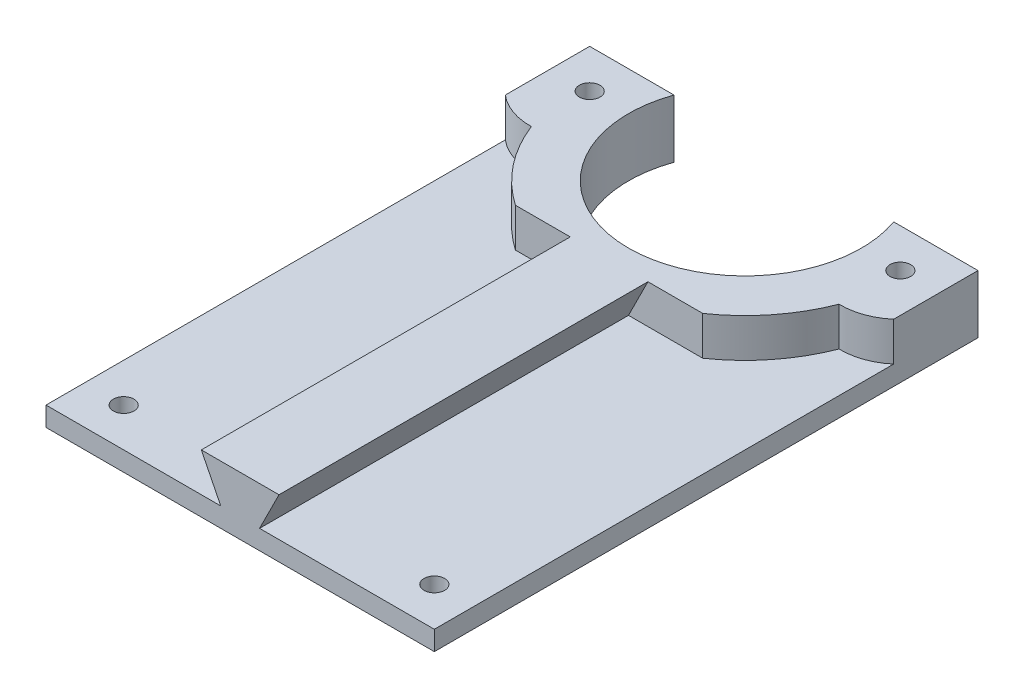
ISO-10303-21;
HEADER;
FILE_DESCRIPTION(('STEP AP214'),'2;1');
FILE_NAME('part.step','',(''),(''),'','','');
FILE_SCHEMA(('AUTOMOTIVE_DESIGN { 1 0 10303 214 1 1 1 1 }'));
ENDSEC;
DATA;
#1=APPLICATION_CONTEXT('core data for automotive mechanical design processes');
#2=APPLICATION_PROTOCOL_DEFINITION('international standard','automotive_design',2000,#1);
#3=PRODUCT_CONTEXT('',#1,'mechanical');
#4=PRODUCT('Part','Part','',(#3));
#5=PRODUCT_RELATED_PRODUCT_CATEGORY('part','',(#4));
#6=PRODUCT_DEFINITION_FORMATION('','',#4);
#7=PRODUCT_DEFINITION_CONTEXT('part definition',#1,'design');
#8=PRODUCT_DEFINITION('design','',#6,#7);
#9=PRODUCT_DEFINITION_SHAPE('','',#8);
#10=(LENGTH_UNIT() NAMED_UNIT(*) SI_UNIT(.MILLI.,.METRE.));
#11=(NAMED_UNIT(*) PLANE_ANGLE_UNIT() SI_UNIT($,.RADIAN.));
#12=(NAMED_UNIT(*) SI_UNIT($,.STERADIAN.) SOLID_ANGLE_UNIT());
#13=UNCERTAINTY_MEASURE_WITH_UNIT(LENGTH_MEASURE(1.E-05),#10,'distance_accuracy_value','');
#14=(GEOMETRIC_REPRESENTATION_CONTEXT(3) GLOBAL_UNCERTAINTY_ASSIGNED_CONTEXT((#13)) GLOBAL_UNIT_ASSIGNED_CONTEXT((#10,
#11,#12)) REPRESENTATION_CONTEXT('',''));
#15=CARTESIAN_POINT('',(0.,0.,0.));
#16=DIRECTION('',(0.,0.,1.));
#17=DIRECTION('',(1.,0.,0.));
#18=AXIS2_PLACEMENT_3D('',#15,#16,#17);
#19=CARTESIAN_POINT('',(0.,19.05,-76.2));
#20=DIRECTION('',(0.,-1.,0.));
#21=DIRECTION('',(0.,0.,-1.));
#22=AXIS2_PLACEMENT_3D('',#19,#20,#21);
#23=CYLINDRICAL_SURFACE('',#22,53.975);
#24=DIRECTION('',(0.,-1.,0.));
#25=VECTOR('',#24,1.);
#26=CARTESIAN_POINT('',(-30.6185911661526,19.05,-31.75));
#27=LINE('',#26,#25);
#28=CARTESIAN_POINT('',(-30.6185911661526,19.05,-31.75));
#29=VERTEX_POINT('',#28);
#30=CARTESIAN_POINT('',(-30.6185911661526,6.35,-31.75));
#31=VERTEX_POINT('',#30);
#32=EDGE_CURVE('E170',#29,#31,#27,.T.);
#33=ORIENTED_EDGE('',*,*,#32,.F.);
#34=CARTESIAN_POINT('',(0.,19.05,-76.2));
#35=DIRECTION('',(0.,1.,0.));
#36=DIRECTION('',(0.,0.,1.));
#37=AXIS2_PLACEMENT_3D('',#34,#35,#36);
#38=CIRCLE('',#37,53.975);
#39=CARTESIAN_POINT('',(-50.3077432342766,19.05,-56.6441416533537));
#40=VERTEX_POINT('',#39);
#41=EDGE_CURVE('E206',#40,#29,#38,.T.);
#42=ORIENTED_EDGE('',*,*,#41,.F.);
#43=DIRECTION('',(0.,-1.,0.));
#44=VECTOR('',#43,1.);
#45=CARTESIAN_POINT('',(-50.3077432342766,19.05,-56.6441416533537));
#46=LINE('',#45,#44);
#47=CARTESIAN_POINT('',(-50.3077432342766,6.35,-56.6441416533537));
#48=VERTEX_POINT('',#47);
#49=EDGE_CURVE('E244',#40,#48,#46,.T.);
#50=ORIENTED_EDGE('',*,*,#49,.T.);
#51=CARTESIAN_POINT('',(0.,6.35,-76.2));
#52=DIRECTION('',(0.,1.,0.));
#53=DIRECTION('',(0.,0.,1.));
#54=AXIS2_PLACEMENT_3D('',#51,#52,#53);
#55=CIRCLE('',#54,53.975);
#56=EDGE_CURVE('E232',#48,#31,#55,.T.);
#57=ORIENTED_EDGE('',*,*,#56,.T.);
#58=EDGE_LOOP('',(#33,#42,#50,#57));
#59=FACE_BOUND('',#58,.T.);
#60=ADVANCED_FACE('F38',(#59),#23,.T.);
#61=DIRECTION('',(0.,-1.,0.));
#62=VECTOR('',#61,1.);
#63=CARTESIAN_POINT('',(30.6185911661526,19.05,-31.75));
#64=LINE('',#63,#62);
#65=CARTESIAN_POINT('',(30.6185911661526,6.35,-31.75));
#66=VERTEX_POINT('',#65);
#67=CARTESIAN_POINT('',(30.6185911661526,19.05,-31.75));
#68=VERTEX_POINT('',#67);
#69=EDGE_CURVE('E61',#66,#68,#64,.F.);
#70=ORIENTED_EDGE('',*,*,#69,.F.);
#71=CARTESIAN_POINT('',(50.3077432342766,6.35,-56.6441416533537));
#72=VERTEX_POINT('',#71);
#73=EDGE_CURVE('E231',#66,#72,#55,.T.);
#74=ORIENTED_EDGE('',*,*,#73,.T.);
#75=DIRECTION('',(0.,-1.,0.));
#76=VECTOR('',#75,1.);
#77=CARTESIAN_POINT('',(50.3077432342766,19.05,-56.6441416533537));
#78=LINE('',#77,#76);
#79=CARTESIAN_POINT('',(50.3077432342766,19.05,-56.6441416533537));
#80=VERTEX_POINT('',#79);
#81=EDGE_CURVE('E241',#80,#72,#78,.T.);
#82=ORIENTED_EDGE('',*,*,#81,.F.);
#83=EDGE_CURVE('E205',#68,#80,#38,.T.);
#84=ORIENTED_EDGE('',*,*,#83,.F.);
#85=EDGE_LOOP('',(#70,#74,#82,#84));
#86=FACE_BOUND('',#85,.T.);
#87=ADVANCED_FACE('F312',(#86),#23,.T.);
#88=CARTESIAN_POINT('',(0.,19.05,0.));
#89=DIRECTION('',(0.,1.,0.));
#90=DIRECTION('',(0.,0.,1.));
#91=AXIS2_PLACEMENT_3D('',#88,#89,#90);
#92=PLANE('',#91);
#93=CARTESIAN_POINT('',(50.8,19.05,-76.2));
#94=DIRECTION('',(0.,1.,0.));
#95=DIRECTION('',(0.,0.,1.));
#96=AXIS2_PLACEMENT_3D('',#93,#94,#95);
#97=CIRCLE('',#96,3.3782);
#98=CARTESIAN_POINT('',(50.8,19.05,-72.8218));
#99=VERTEX_POINT('',#98);
#100=EDGE_CURVE('E198',#99,#99,#97,.F.);
#101=ORIENTED_EDGE('',*,*,#100,.T.);
#102=EDGE_LOOP('',(#101));
#103=FACE_BOUND('',#102,.T.);
#104=CARTESIAN_POINT('',(-50.8,19.05,-76.2));
#105=DIRECTION('',(0.,1.,0.));
#106=DIRECTION('',(0.,0.,1.));
#107=AXIS2_PLACEMENT_3D('',#104,#105,#106);
#108=CIRCLE('',#107,3.3782);
#109=CARTESIAN_POINT('',(-50.8,19.05,-72.8218));
#110=VERTEX_POINT('',#109);
#111=EDGE_CURVE('E225',#110,#110,#108,.F.);
#112=ORIENTED_EDGE('',*,*,#111,.T.);
#113=EDGE_LOOP('',(#112));
#114=FACE_BOUND('',#113,.T.);
#115=DIRECTION('',(-1.,0.,0.));
#116=VECTOR('',#115,1.);
#117=CARTESIAN_POINT('',(0.,19.05,-31.75));
#118=LINE('',#117,#116);
#119=CARTESIAN_POINT('',(-12.7,19.05,-31.75));
#120=VERTEX_POINT('',#119);
#121=EDGE_CURVE('E171',#120,#29,#118,.T.);
#122=ORIENTED_EDGE('',*,*,#121,.F.);
#123=DIRECTION('',(0.,0.,1.));
#124=VECTOR('',#123,1.);
#125=CARTESIAN_POINT('',(-12.7,19.05,-32.766));
#126=LINE('',#125,#124);
#127=CARTESIAN_POINT('',(-12.7,19.05,88.9));
#128=VERTEX_POINT('',#127);
#129=EDGE_CURVE('E53',#120,#128,#126,.T.);
#130=ORIENTED_EDGE('',*,*,#129,.T.);
#131=DIRECTION('',(1.,0.,0.));
#132=VECTOR('',#131,1.);
#133=CARTESIAN_POINT('',(0.,19.05,88.9));
#134=LINE('',#133,#132);
#135=CARTESIAN_POINT('',(12.7,19.05,88.9));
#136=VERTEX_POINT('',#135);
#137=EDGE_CURVE('E188',#128,#136,#134,.T.);
#138=ORIENTED_EDGE('',*,*,#137,.T.);
#139=DIRECTION('',(0.,0.,1.));
#140=VECTOR('',#139,1.);
#141=CARTESIAN_POINT('',(12.7,19.05,-32.766));
#142=LINE('',#141,#140);
#143=CARTESIAN_POINT('',(12.7,19.05,-31.75));
#144=VERTEX_POINT('',#143);
#145=EDGE_CURVE('E195',#144,#136,#142,.T.);
#146=ORIENTED_EDGE('',*,*,#145,.F.);
#147=DIRECTION('',(-1.,0.,0.));
#148=VECTOR('',#147,1.);
#149=CARTESIAN_POINT('',(0.,19.05,-31.75));
#150=LINE('',#149,#148);
#151=EDGE_CURVE('E179',#68,#144,#150,.T.);
#152=ORIENTED_EDGE('',*,*,#151,.F.);
#153=ORIENTED_EDGE('',*,*,#83,.T.);
#154=CARTESIAN_POINT('',(50.8,19.05,-76.2));
#155=DIRECTION('',(0.,1.,0.));
#156=DIRECTION('',(0.,0.,1.));
#157=AXIS2_PLACEMENT_3D('',#154,#155,#156);
#158=CIRCLE('',#157,19.5620528676695);
#159=CARTESIAN_POINT('',(63.5,19.05,-61.3210244842766));
#160=VERTEX_POINT('',#159);
#161=EDGE_CURVE('E209',#80,#160,#158,.T.);
#162=ORIENTED_EDGE('',*,*,#161,.T.);
#163=DIRECTION('',(0.,0.,-1.));
#164=VECTOR('',#163,1.);
#165=CARTESIAN_POINT('',(63.5,19.05,0.));
#166=LINE('',#165,#164);
#167=CARTESIAN_POINT('',(63.5,19.05,-88.9));
#168=VERTEX_POINT('',#167);
#169=EDGE_CURVE('E211',#160,#168,#166,.T.);
#170=ORIENTED_EDGE('',*,*,#169,.T.);
#171=DIRECTION('',(-1.,0.,0.));
#172=VECTOR('',#171,1.);
#173=CARTESIAN_POINT('',(0.,19.05,-88.9));
#174=LINE('',#173,#172);
#175=CARTESIAN_POINT('',(35.9210244842766,19.05,-88.9));
#176=VERTEX_POINT('',#175);
#177=EDGE_CURVE('E214',#168,#176,#174,.T.);
#178=ORIENTED_EDGE('',*,*,#177,.T.);
#179=CARTESIAN_POINT('',(0.,19.05,-76.2));
#180=DIRECTION('',(0.,1.,0.));
#181=DIRECTION('',(0.,0.,1.));
#182=AXIS2_PLACEMENT_3D('',#179,#180,#181);
#183=CIRCLE('',#182,38.1);
#184=CARTESIAN_POINT('',(-35.9210244842766,19.05,-88.9));
#185=VERTEX_POINT('',#184);
#186=EDGE_CURVE('E217',#176,#185,#183,.F.);
#187=ORIENTED_EDGE('',*,*,#186,.T.);
#188=DIRECTION('',(-1.,0.,0.));
#189=VECTOR('',#188,1.);
#190=CARTESIAN_POINT('',(0.,19.05,-88.9));
#191=LINE('',#190,#189);
#192=CARTESIAN_POINT('',(-63.5,19.05,-88.9));
#193=VERTEX_POINT('',#192);
#194=EDGE_CURVE('E220',#185,#193,#191,.T.);
#195=ORIENTED_EDGE('',*,*,#194,.T.);
#196=DIRECTION('',(0.,0.,1.));
#197=VECTOR('',#196,1.);
#198=CARTESIAN_POINT('',(-63.5,19.05,0.));
#199=LINE('',#198,#197);
#200=CARTESIAN_POINT('',(-63.5,19.05,-61.3210244842766));
#201=VERTEX_POINT('',#200);
#202=EDGE_CURVE('E223',#193,#201,#199,.T.);
#203=ORIENTED_EDGE('',*,*,#202,.T.);
#204=CARTESIAN_POINT('',(-50.8,19.05,-76.2));
#205=DIRECTION('',(0.,1.,0.));
#206=DIRECTION('',(0.,0.,1.));
#207=AXIS2_PLACEMENT_3D('',#204,#205,#206);
#208=CIRCLE('',#207,19.5620528676695);
#209=EDGE_CURVE('E201',#201,#40,#208,.T.);
#210=ORIENTED_EDGE('',*,*,#209,.T.);
#211=ORIENTED_EDGE('',*,*,#41,.T.);
#212=EDGE_LOOP('',(#122,#130,#138,#146,#152,#153,#162,#170,#178,#187,#195,#203,#210,#211));
#213=FACE_BOUND('',#212,.T.);
#214=ADVANCED_FACE('F309',(#103,#114,#213),#92,.T.);
#215=CARTESIAN_POINT('',(0.,6.35,0.));
#216=DIRECTION('',(0.,1.,0.));
#217=DIRECTION('',(0.,0.,1.));
#218=AXIS2_PLACEMENT_3D('',#215,#216,#217);
#219=PLANE('',#218);
#220=CARTESIAN_POINT('',(-50.8,6.35,76.2));
#221=DIRECTION('',(0.,1.,0.));
#222=DIRECTION('',(0.,0.,1.));
#223=AXIS2_PLACEMENT_3D('',#220,#221,#222);
#224=CIRCLE('',#223,3.3782);
#225=CARTESIAN_POINT('',(-50.8,6.35,79.5782));
#226=VERTEX_POINT('',#225);
#227=EDGE_CURVE('E257',#226,#226,#224,.T.);
#228=ORIENTED_EDGE('',*,*,#227,.F.);
#229=EDGE_LOOP('',(#228));
#230=FACE_BOUND('',#229,.T.);
#231=DIRECTION('',(1.,0.,0.));
#232=VECTOR('',#231,1.);
#233=CARTESIAN_POINT('',(63.5,6.35,88.8999999999999));
#234=LINE('',#233,#232);
#235=CARTESIAN_POINT('',(-63.5,6.35,88.9));
#236=VERTEX_POINT('',#235);
#237=CARTESIAN_POINT('',(-6.34999999999997,6.35,88.9));
#238=VERTEX_POINT('',#237);
#239=EDGE_CURVE('E159',#236,#238,#234,.T.);
#240=ORIENTED_EDGE('',*,*,#239,.T.);
#241=DIRECTION('',(0.,0.,1.));
#242=VECTOR('',#241,1.);
#243=CARTESIAN_POINT('',(-6.34999999999997,6.35,-32.766));
#244=LINE('',#243,#242);
#245=CARTESIAN_POINT('',(-6.34999999999997,6.35,-31.75));
#246=VERTEX_POINT('',#245);
#247=EDGE_CURVE('E153',#246,#238,#244,.T.);
#248=ORIENTED_EDGE('',*,*,#247,.F.);
#249=DIRECTION('',(-1.,0.,0.));
#250=VECTOR('',#249,1.);
#251=CARTESIAN_POINT('',(0.,6.35,-31.75));
#252=LINE('',#251,#250);
#253=EDGE_CURVE('E156',#246,#31,#252,.T.);
#254=ORIENTED_EDGE('',*,*,#253,.T.);
#255=ORIENTED_EDGE('',*,*,#56,.F.);
#256=CARTESIAN_POINT('',(-50.8,6.35,-76.2));
#257=DIRECTION('',(0.,1.,0.));
#258=DIRECTION('',(0.,0.,1.));
#259=AXIS2_PLACEMENT_3D('',#256,#257,#258);
#260=CIRCLE('',#259,19.5620528676695);
#261=CARTESIAN_POINT('',(-63.5,6.35,-61.3210244842766));
#262=VERTEX_POINT('',#261);
#263=EDGE_CURVE('E161',#262,#48,#260,.T.);
#264=ORIENTED_EDGE('',*,*,#263,.F.);
#265=DIRECTION('',(0.,0.,1.));
#266=VECTOR('',#265,1.);
#267=CARTESIAN_POINT('',(-63.5,6.35,88.9));
#268=LINE('',#267,#266);
#269=EDGE_CURVE('E262',#262,#236,#268,.T.);
#270=ORIENTED_EDGE('',*,*,#269,.T.);
#271=EDGE_LOOP('',(#240,#248,#254,#255,#264,#270));
#272=FACE_BOUND('',#271,.T.);
#273=ADVANCED_FACE('F154',(#230,#272),#219,.T.);
#274=CARTESIAN_POINT('',(50.8,6.35,76.2));
#275=DIRECTION('',(0.,1.,0.));
#276=DIRECTION('',(0.,0.,1.));
#277=AXIS2_PLACEMENT_3D('',#274,#275,#276);
#278=CIRCLE('',#277,3.3782);
#279=CARTESIAN_POINT('',(50.8,6.35,79.5782));
#280=VERTEX_POINT('',#279);
#281=EDGE_CURVE('E253',#280,#280,#278,.T.);
#282=ORIENTED_EDGE('',*,*,#281,.F.);
#283=EDGE_LOOP('',(#282));
#284=FACE_BOUND('',#283,.T.);
#285=CARTESIAN_POINT('',(6.35000000000003,6.35,88.9));
#286=VERTEX_POINT('',#285);
#287=CARTESIAN_POINT('',(63.5,6.35,88.8999999999999));
#288=VERTEX_POINT('',#287);
#289=EDGE_CURVE('E264',#286,#288,#234,.T.);
#290=ORIENTED_EDGE('',*,*,#289,.T.);
#291=DIRECTION('',(0.,0.,-1.));
#292=VECTOR('',#291,1.);
#293=CARTESIAN_POINT('',(63.5,6.35,88.8999999999999));
#294=LINE('',#293,#292);
#295=CARTESIAN_POINT('',(63.5,6.35,-61.3210244842766));
#296=VERTEX_POINT('',#295);
#297=EDGE_CURVE('E267',#288,#296,#294,.T.);
#298=ORIENTED_EDGE('',*,*,#297,.T.);
#299=CARTESIAN_POINT('',(50.8,6.35,-76.2));
#300=DIRECTION('',(0.,1.,0.));
#301=DIRECTION('',(0.,0.,1.));
#302=AXIS2_PLACEMENT_3D('',#299,#300,#301);
#303=CIRCLE('',#302,19.5620528676695);
#304=EDGE_CURVE('E202',#72,#296,#303,.T.);
#305=ORIENTED_EDGE('',*,*,#304,.F.);
#306=ORIENTED_EDGE('',*,*,#73,.F.);
#307=DIRECTION('',(-1.,0.,0.));
#308=VECTOR('',#307,1.);
#309=CARTESIAN_POINT('',(0.,6.35,-31.75));
#310=LINE('',#309,#308);
#311=CARTESIAN_POINT('',(6.35000000000003,6.35,-31.75));
#312=VERTEX_POINT('',#311);
#313=EDGE_CURVE('E176',#66,#312,#310,.T.);
#314=ORIENTED_EDGE('',*,*,#313,.T.);
#315=DIRECTION('',(0.,0.,1.));
#316=VECTOR('',#315,1.);
#317=CARTESIAN_POINT('',(6.35000000000003,6.35,-32.766));
#318=LINE('',#317,#316);
#319=EDGE_CURVE('E192',#312,#286,#318,.T.);
#320=ORIENTED_EDGE('',*,*,#319,.T.);
#321=EDGE_LOOP('',(#290,#298,#305,#306,#314,#320));
#322=FACE_BOUND('',#321,.T.);
#323=ADVANCED_FACE('F345',(#284,#322),#219,.T.);
#324=CARTESIAN_POINT('',(63.5,6.35,-88.9));
#325=DIRECTION('',(0.,0.,1.));
#326=DIRECTION('',(1.,0.,0.));
#327=AXIS2_PLACEMENT_3D('',#324,#325,#326);
#328=PLANE('',#327);
#329=DIRECTION('',(-1.,0.,0.));
#330=VECTOR('',#329,1.);
#331=CARTESIAN_POINT('',(63.5,0.,-88.9));
#332=LINE('',#331,#330);
#333=CARTESIAN_POINT('',(63.5,0.,-88.9));
#334=VERTEX_POINT('',#333);
#335=CARTESIAN_POINT('',(35.9210244842766,0.,-88.9));
#336=VERTEX_POINT('',#335);
#337=EDGE_CURVE('E265',#334,#336,#332,.T.);
#338=ORIENTED_EDGE('',*,*,#337,.T.);
#339=DIRECTION('',(0.,1.,0.));
#340=VECTOR('',#339,1.);
#341=CARTESIAN_POINT('',(35.9210244842766,0.,-88.9));
#342=LINE('',#341,#340);
#343=EDGE_CURVE('E250',#336,#176,#342,.T.);
#344=ORIENTED_EDGE('',*,*,#343,.T.);
#345=ORIENTED_EDGE('',*,*,#177,.F.);
#346=DIRECTION('',(0.,-1.,0.));
#347=VECTOR('',#346,1.);
#348=CARTESIAN_POINT('',(63.5,6.35,-88.9));
#349=LINE('',#348,#347);
#350=EDGE_CURVE('E282',#168,#334,#349,.T.);
#351=ORIENTED_EDGE('',*,*,#350,.T.);
#352=EDGE_LOOP('',(#338,#344,#345,#351));
#353=FACE_BOUND('',#352,.T.);
#354=ADVANCED_FACE('F359',(#353),#328,.F.);
#355=CARTESIAN_POINT('',(-63.5,6.35,88.9));
#356=DIRECTION('',(1.,0.,0.));
#357=DIRECTION('',(0.,0.,-1.));
#358=AXIS2_PLACEMENT_3D('',#355,#356,#357);
#359=PLANE('',#358);
#360=DIRECTION('',(0.,0.,1.));
#361=VECTOR('',#360,1.);
#362=CARTESIAN_POINT('',(-63.5,0.,88.9));
#363=LINE('',#362,#361);
#364=CARTESIAN_POINT('',(-63.5,0.,-88.9));
#365=VERTEX_POINT('',#364);
#366=CARTESIAN_POINT('',(-63.5,0.,88.9));
#367=VERTEX_POINT('',#366);
#368=EDGE_CURVE('E270',#365,#367,#363,.T.);
#369=ORIENTED_EDGE('',*,*,#368,.T.);
#370=DIRECTION('',(0.,-1.,0.));
#371=VECTOR('',#370,1.);
#372=CARTESIAN_POINT('',(-63.5,6.35,88.9));
#373=LINE('',#372,#371);
#374=EDGE_CURVE('E46',#236,#367,#373,.T.);
#375=ORIENTED_EDGE('',*,*,#374,.F.);
#376=ORIENTED_EDGE('',*,*,#269,.F.);
#377=DIRECTION('',(0.,-1.,0.));
#378=VECTOR('',#377,1.);
#379=CARTESIAN_POINT('',(-63.5,19.05,-61.3210244842766));
#380=LINE('',#379,#378);
#381=EDGE_CURVE('E228',#201,#262,#380,.T.);
#382=ORIENTED_EDGE('',*,*,#381,.F.);
#383=ORIENTED_EDGE('',*,*,#202,.F.);
#384=DIRECTION('',(0.,-1.,0.));
#385=VECTOR('',#384,1.);
#386=CARTESIAN_POINT('',(-63.5,6.35,-88.9));
#387=LINE('',#386,#385);
#388=EDGE_CURVE('E269',#193,#365,#387,.T.);
#389=ORIENTED_EDGE('',*,*,#388,.T.);
#390=EDGE_LOOP('',(#369,#375,#376,#382,#383,#389));
#391=FACE_BOUND('',#390,.T.);
#392=ADVANCED_FACE('F40',(#391),#359,.F.);
#393=CARTESIAN_POINT('',(63.5,6.35,88.8999999999999));
#394=DIRECTION('',(0.,0.,-1.));
#395=DIRECTION('',(-1.,0.,0.));
#396=AXIS2_PLACEMENT_3D('',#393,#394,#395);
#397=PLANE('',#396);
#398=DIRECTION('',(1.,0.,0.));
#399=VECTOR('',#398,1.);
#400=CARTESIAN_POINT('',(63.5,0.,88.8999999999999));
#401=LINE('',#400,#399);
#402=CARTESIAN_POINT('',(63.5,0.,88.8999999999999));
#403=VERTEX_POINT('',#402);
#404=EDGE_CURVE('E273',#367,#403,#401,.T.);
#405=ORIENTED_EDGE('',*,*,#404,.T.);
#406=DIRECTION('',(0.,-1.,0.));
#407=VECTOR('',#406,1.);
#408=CARTESIAN_POINT('',(63.5,6.35,88.8999999999999));
#409=LINE('',#408,#407);
#410=EDGE_CURVE('E285',#288,#403,#409,.T.);
#411=ORIENTED_EDGE('',*,*,#410,.F.);
#412=ORIENTED_EDGE('',*,*,#289,.F.);
#413=DIRECTION('',(-0.447213595499958,-0.894427190999916,0.));
#414=VECTOR('',#413,1.);
#415=CARTESIAN_POINT('',(2.54000000000002,-1.27000000000001,88.9));
#416=LINE('',#415,#414);
#417=EDGE_CURVE('E185',#136,#286,#416,.T.);
#418=ORIENTED_EDGE('',*,*,#417,.F.);
#419=ORIENTED_EDGE('',*,*,#137,.F.);
#420=DIRECTION('',(-0.447213595499958,0.894427190999916,0.));
#421=VECTOR('',#420,1.);
#422=CARTESIAN_POINT('',(-2.53999999999998,-1.26999999999999,88.9));
#423=LINE('',#422,#421);
#424=EDGE_CURVE('E191',#238,#128,#423,.T.);
#425=ORIENTED_EDGE('',*,*,#424,.F.);
#426=ORIENTED_EDGE('',*,*,#239,.F.);
#427=ORIENTED_EDGE('',*,*,#374,.T.);
#428=EDGE_LOOP('',(#405,#411,#412,#418,#419,#425,#426,#427));
#429=FACE_BOUND('',#428,.T.);
#430=ADVANCED_FACE('F334',(#429),#397,.F.);
#431=CARTESIAN_POINT('',(63.5,6.35,88.8999999999999));
#432=DIRECTION('',(-1.,0.,0.));
#433=DIRECTION('',(0.,0.,1.));
#434=AXIS2_PLACEMENT_3D('',#431,#432,#433);
#435=PLANE('',#434);
#436=DIRECTION('',(0.,0.,-1.));
#437=VECTOR('',#436,1.);
#438=CARTESIAN_POINT('',(63.5,0.,88.8999999999999));
#439=LINE('',#438,#437);
#440=EDGE_CURVE('E275',#403,#334,#439,.T.);
#441=ORIENTED_EDGE('',*,*,#440,.T.);
#442=ORIENTED_EDGE('',*,*,#350,.F.);
#443=ORIENTED_EDGE('',*,*,#169,.F.);
#444=DIRECTION('',(0.,-1.,0.));
#445=VECTOR('',#444,1.);
#446=CARTESIAN_POINT('',(63.5,19.05,-61.3210244842766));
#447=LINE('',#446,#445);
#448=EDGE_CURVE('E238',#160,#296,#447,.T.);
#449=ORIENTED_EDGE('',*,*,#448,.T.);
#450=ORIENTED_EDGE('',*,*,#297,.F.);
#451=ORIENTED_EDGE('',*,*,#410,.T.);
#452=EDGE_LOOP('',(#441,#442,#443,#449,#450,#451));
#453=FACE_BOUND('',#452,.T.);
#454=ADVANCED_FACE('F357',(#453),#435,.F.);
#455=ORIENTED_EDGE('',*,*,#388,.F.);
#456=ORIENTED_EDGE('',*,*,#194,.F.);
#457=DIRECTION('',(0.,1.,0.));
#458=VECTOR('',#457,1.);
#459=CARTESIAN_POINT('',(-35.9210244842766,0.,-88.9));
#460=LINE('',#459,#458);
#461=CARTESIAN_POINT('',(-35.9210244842766,0.,-88.9));
#462=VERTEX_POINT('',#461);
#463=EDGE_CURVE('E247',#185,#462,#460,.F.);
#464=ORIENTED_EDGE('',*,*,#463,.T.);
#465=EDGE_CURVE('E277',#462,#365,#332,.T.);
#466=ORIENTED_EDGE('',*,*,#465,.T.);
#467=EDGE_LOOP('',(#455,#456,#464,#466));
#468=FACE_BOUND('',#467,.T.);
#469=ADVANCED_FACE('F362',(#468),#328,.F.);
#470=CARTESIAN_POINT('',(0.,0.,0.));
#471=DIRECTION('',(0.,1.,0.));
#472=DIRECTION('',(0.,0.,1.));
#473=AXIS2_PLACEMENT_3D('',#470,#471,#472);
#474=PLANE('',#473);
#475=CARTESIAN_POINT('',(-50.8,0.,-76.2));
#476=DIRECTION('',(0.,1.,0.));
#477=DIRECTION('',(0.,0.,1.));
#478=AXIS2_PLACEMENT_3D('',#475,#476,#477);
#479=CIRCLE('',#478,3.3782);
#480=CARTESIAN_POINT('',(-50.8,0.,-72.8218));
#481=VERTEX_POINT('',#480);
#482=EDGE_CURVE('E252',#481,#481,#479,.T.);
#483=ORIENTED_EDGE('',*,*,#482,.T.);
#484=EDGE_LOOP('',(#483));
#485=FACE_BOUND('',#484,.T.);
#486=CARTESIAN_POINT('',(50.8,0.,76.2));
#487=DIRECTION('',(0.,1.,0.));
#488=DIRECTION('',(0.,0.,1.));
#489=AXIS2_PLACEMENT_3D('',#486,#487,#488);
#490=CIRCLE('',#489,3.3782);
#491=CARTESIAN_POINT('',(50.8,0.,79.5782));
#492=VERTEX_POINT('',#491);
#493=EDGE_CURVE('E256',#492,#492,#490,.T.);
#494=ORIENTED_EDGE('',*,*,#493,.T.);
#495=EDGE_LOOP('',(#494));
#496=FACE_BOUND('',#495,.T.);
#497=CARTESIAN_POINT('',(50.8,0.,-76.2));
#498=DIRECTION('',(0.,1.,0.));
#499=DIRECTION('',(0.,0.,1.));
#500=AXIS2_PLACEMENT_3D('',#497,#498,#499);
#501=CIRCLE('',#500,3.3782);
#502=CARTESIAN_POINT('',(50.8,0.,-72.8218));
#503=VERTEX_POINT('',#502);
#504=EDGE_CURVE('E261',#503,#503,#501,.T.);
#505=ORIENTED_EDGE('',*,*,#504,.T.);
#506=EDGE_LOOP('',(#505));
#507=FACE_BOUND('',#506,.T.);
#508=CARTESIAN_POINT('',(-50.8,0.,76.2));
#509=DIRECTION('',(0.,1.,0.));
#510=DIRECTION('',(0.,0.,1.));
#511=AXIS2_PLACEMENT_3D('',#508,#509,#510);
#512=CIRCLE('',#511,3.3782);
#513=CARTESIAN_POINT('',(-50.8,0.,79.5782));
#514=VERTEX_POINT('',#513);
#515=EDGE_CURVE('E260',#514,#514,#512,.T.);
#516=ORIENTED_EDGE('',*,*,#515,.T.);
#517=EDGE_LOOP('',(#516));
#518=FACE_BOUND('',#517,.T.);
#519=ORIENTED_EDGE('',*,*,#465,.F.);
#520=CARTESIAN_POINT('',(0.,0.,-76.2));
#521=DIRECTION('',(0.,1.,0.));
#522=DIRECTION('',(0.,0.,1.));
#523=AXIS2_PLACEMENT_3D('',#520,#521,#522);
#524=CIRCLE('',#523,38.1);
#525=EDGE_CURVE('E11',#462,#336,#524,.T.);
#526=ORIENTED_EDGE('',*,*,#525,.T.);
#527=ORIENTED_EDGE('',*,*,#337,.F.);
#528=ORIENTED_EDGE('',*,*,#440,.F.);
#529=ORIENTED_EDGE('',*,*,#404,.F.);
#530=ORIENTED_EDGE('',*,*,#368,.F.);
#531=EDGE_LOOP('',(#519,#526,#527,#528,#529,#530));
#532=FACE_BOUND('',#531,.T.);
#533=ADVANCED_FACE('F298',(#485,#496,#507,#518,#532),#474,.F.);
#534=CARTESIAN_POINT('',(-50.8,6.35,76.2));
#535=DIRECTION('',(0.,1.,0.));
#536=DIRECTION('',(0.,0.,1.));
#537=AXIS2_PLACEMENT_3D('',#534,#535,#536);
#538=CYLINDRICAL_SURFACE('',#537,3.3782);
#539=ORIENTED_EDGE('',*,*,#227,.T.);
#540=EDGE_LOOP('',(#539));
#541=FACE_BOUND('',#540,.T.);
#542=ORIENTED_EDGE('',*,*,#515,.F.);
#543=EDGE_LOOP('',(#542));
#544=FACE_BOUND('',#543,.T.);
#545=ADVANCED_FACE('F369',(#541,#544),#538,.F.);
#546=CARTESIAN_POINT('',(50.8,6.35,-76.2));
#547=DIRECTION('',(0.,1.,0.));
#548=DIRECTION('',(0.,0.,1.));
#549=AXIS2_PLACEMENT_3D('',#546,#547,#548);
#550=CYLINDRICAL_SURFACE('',#549,3.3782);
#551=ORIENTED_EDGE('',*,*,#504,.F.);
#552=EDGE_LOOP('',(#551));
#553=FACE_BOUND('',#552,.T.);
#554=ORIENTED_EDGE('',*,*,#100,.F.);
#555=EDGE_LOOP('',(#554));
#556=FACE_BOUND('',#555,.T.);
#557=ADVANCED_FACE('F386',(#553,#556),#550,.F.);
#558=CARTESIAN_POINT('',(50.8,6.35,76.2));
#559=DIRECTION('',(0.,1.,0.));
#560=DIRECTION('',(0.,0.,1.));
#561=AXIS2_PLACEMENT_3D('',#558,#559,#560);
#562=CYLINDRICAL_SURFACE('',#561,3.3782);
#563=ORIENTED_EDGE('',*,*,#281,.T.);
#564=EDGE_LOOP('',(#563));
#565=FACE_BOUND('',#564,.T.);
#566=ORIENTED_EDGE('',*,*,#493,.F.);
#567=EDGE_LOOP('',(#566));
#568=FACE_BOUND('',#567,.T.);
#569=ADVANCED_FACE('F305',(#565,#568),#562,.F.);
#570=CARTESIAN_POINT('',(-50.8,6.35,-76.2));
#571=DIRECTION('',(0.,1.,0.));
#572=DIRECTION('',(0.,0.,1.));
#573=AXIS2_PLACEMENT_3D('',#570,#571,#572);
#574=CYLINDRICAL_SURFACE('',#573,3.3782);
#575=ORIENTED_EDGE('',*,*,#482,.F.);
#576=EDGE_LOOP('',(#575));
#577=FACE_BOUND('',#576,.T.);
#578=ORIENTED_EDGE('',*,*,#111,.F.);
#579=EDGE_LOOP('',(#578));
#580=FACE_BOUND('',#579,.T.);
#581=ADVANCED_FACE('F301',(#577,#580),#574,.F.);
#582=CARTESIAN_POINT('',(0.,0.,-76.2));
#583=DIRECTION('',(0.,1.,0.));
#584=DIRECTION('',(0.,0.,1.));
#585=AXIS2_PLACEMENT_3D('',#582,#583,#584);
#586=CYLINDRICAL_SURFACE('',#585,38.1);
#587=ORIENTED_EDGE('',*,*,#525,.F.);
#588=ORIENTED_EDGE('',*,*,#463,.F.);
#589=ORIENTED_EDGE('',*,*,#186,.F.);
#590=ORIENTED_EDGE('',*,*,#343,.F.);
#591=EDGE_LOOP('',(#587,#588,#589,#590));
#592=FACE_BOUND('',#591,.T.);
#593=ADVANCED_FACE('F304',(#592),#586,.F.);
#594=CARTESIAN_POINT('',(-50.8,19.05,-76.2));
#595=DIRECTION('',(0.,-1.,0.));
#596=DIRECTION('',(0.,0.,-1.));
#597=AXIS2_PLACEMENT_3D('',#594,#595,#596);
#598=CYLINDRICAL_SURFACE('',#597,19.5620528676695);
#599=ORIENTED_EDGE('',*,*,#263,.T.);
#600=ORIENTED_EDGE('',*,*,#49,.F.);
#601=ORIENTED_EDGE('',*,*,#209,.F.);
#602=ORIENTED_EDGE('',*,*,#381,.T.);
#603=EDGE_LOOP('',(#599,#600,#601,#602));
#604=FACE_BOUND('',#603,.T.);
#605=ADVANCED_FACE('F324',(#604),#598,.T.);
#606=CARTESIAN_POINT('',(50.8,19.05,-76.2));
#607=DIRECTION('',(0.,-1.,0.));
#608=DIRECTION('',(0.,0.,-1.));
#609=AXIS2_PLACEMENT_3D('',#606,#607,#608);
#610=CYLINDRICAL_SURFACE('',#609,19.5620528676695);
#611=ORIENTED_EDGE('',*,*,#304,.T.);
#612=ORIENTED_EDGE('',*,*,#448,.F.);
#613=ORIENTED_EDGE('',*,*,#161,.F.);
#614=ORIENTED_EDGE('',*,*,#81,.T.);
#615=EDGE_LOOP('',(#611,#612,#613,#614));
#616=FACE_BOUND('',#615,.T.);
#617=ADVANCED_FACE('F354',(#616),#610,.T.);
#618=CARTESIAN_POINT('',(-2.53999999999998,-1.26999999999999,-32.766));
#619=DIRECTION('',(0.894427190999916,0.447213595499958,0.));
#620=DIRECTION('',(-0.447213595499958,0.894427190999916,0.));
#621=AXIS2_PLACEMENT_3D('',#618,#619,#620);
#622=PLANE('',#621);
#623=ORIENTED_EDGE('',*,*,#129,.F.);
#624=DIRECTION('',(0.447213595499958,-0.894427190999916,0.));
#625=VECTOR('',#624,1.);
#626=CARTESIAN_POINT('',(-2.53999999999998,-1.26999999999999,-31.75));
#627=LINE('',#626,#625);
#628=EDGE_CURVE('E163',#120,#246,#627,.T.);
#629=ORIENTED_EDGE('',*,*,#628,.T.);
#630=ORIENTED_EDGE('',*,*,#247,.T.);
#631=ORIENTED_EDGE('',*,*,#424,.T.);
#632=EDGE_LOOP('',(#623,#629,#630,#631));
#633=FACE_BOUND('',#632,.T.);
#634=ADVANCED_FACE('F164',(#633),#622,.F.);
#635=CARTESIAN_POINT('',(2.54000000000002,-1.27000000000001,-32.766));
#636=DIRECTION('',(-0.894427190999916,0.447213595499958,0.));
#637=DIRECTION('',(-0.447213595499958,-0.894427190999916,0.));
#638=AXIS2_PLACEMENT_3D('',#635,#636,#637);
#639=PLANE('',#638);
#640=ORIENTED_EDGE('',*,*,#319,.F.);
#641=DIRECTION('',(0.447213595499958,0.894427190999916,0.));
#642=VECTOR('',#641,1.);
#643=CARTESIAN_POINT('',(2.54000000000002,-1.27000000000001,-31.75));
#644=LINE('',#643,#642);
#645=EDGE_CURVE('E173',#312,#144,#644,.T.);
#646=ORIENTED_EDGE('',*,*,#645,.T.);
#647=ORIENTED_EDGE('',*,*,#145,.T.);
#648=ORIENTED_EDGE('',*,*,#417,.T.);
#649=EDGE_LOOP('',(#640,#646,#647,#648));
#650=FACE_BOUND('',#649,.T.);
#651=ADVANCED_FACE('F342',(#650),#639,.F.);
#652=CARTESIAN_POINT('',(0.,0.,-31.75));
#653=DIRECTION('',(0.,0.,1.));
#654=DIRECTION('',(1.,0.,0.));
#655=AXIS2_PLACEMENT_3D('',#652,#653,#654);
#656=PLANE('',#655);
#657=ORIENTED_EDGE('',*,*,#69,.T.);
#658=ORIENTED_EDGE('',*,*,#151,.T.);
#659=ORIENTED_EDGE('',*,*,#645,.F.);
#660=ORIENTED_EDGE('',*,*,#313,.F.);
#661=EDGE_LOOP('',(#657,#658,#659,#660));
#662=FACE_BOUND('',#661,.T.);
#663=ADVANCED_FACE('F341',(#662),#656,.T.);
#664=CARTESIAN_POINT('',(0.,0.,-31.75));
#665=DIRECTION('',(0.,0.,1.));
#666=DIRECTION('',(1.,0.,0.));
#667=AXIS2_PLACEMENT_3D('',#664,#665,#666);
#668=PLANE('',#667);
#669=ORIENTED_EDGE('',*,*,#32,.T.);
#670=ORIENTED_EDGE('',*,*,#253,.F.);
#671=ORIENTED_EDGE('',*,*,#628,.F.);
#672=ORIENTED_EDGE('',*,*,#121,.T.);
#673=EDGE_LOOP('',(#669,#670,#671,#672));
#674=FACE_BOUND('',#673,.T.);
#675=ADVANCED_FACE('F168',(#674),#668,.T.);
#676=CLOSED_SHELL('',(#60,#87,#214,#273,#323,#354,#392,#430,#454,#469,#533,#545,#557,#569,#581,
#593,#605,#617,#634,#651,#663,#675));
#677=MANIFOLD_SOLID_BREP('B2',#676);
#678=ADVANCED_BREP_SHAPE_REPRESENTATION('',(#18,#677),#14);
#679=SHAPE_DEFINITION_REPRESENTATION(#9,#678);
ENDSEC;
END-ISO-10303-21;
